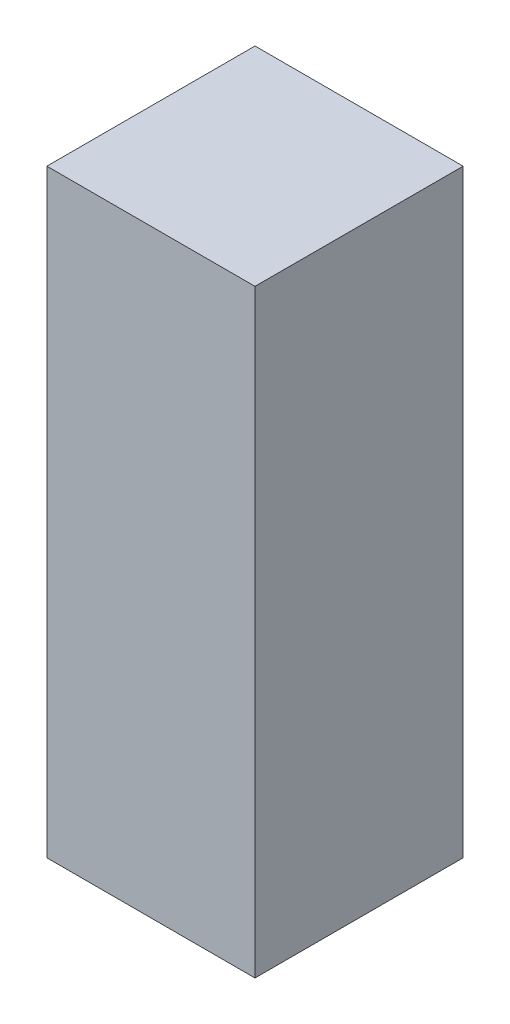
ISO-10303-21;
HEADER;
FILE_DESCRIPTION(('STEP AP214'),'2;1');
FILE_NAME('part.step','',(''),(''),'','','');
FILE_SCHEMA(('AUTOMOTIVE_DESIGN { 1 0 10303 214 1 1 1 1 }'));
ENDSEC;
DATA;
#1=APPLICATION_CONTEXT('core data for automotive mechanical design processes');
#2=APPLICATION_PROTOCOL_DEFINITION('international standard','automotive_design',2000,#1);
#3=PRODUCT_CONTEXT('',#1,'mechanical');
#4=PRODUCT('Part','Part','',(#3));
#5=PRODUCT_RELATED_PRODUCT_CATEGORY('part','',(#4));
#6=PRODUCT_DEFINITION_FORMATION('','',#4);
#7=PRODUCT_DEFINITION_CONTEXT('part definition',#1,'design');
#8=PRODUCT_DEFINITION('design','',#6,#7);
#9=PRODUCT_DEFINITION_SHAPE('','',#8);
#10=(LENGTH_UNIT() NAMED_UNIT(*) SI_UNIT(.MILLI.,.METRE.));
#11=(NAMED_UNIT(*) PLANE_ANGLE_UNIT() SI_UNIT($,.RADIAN.));
#12=(NAMED_UNIT(*) SI_UNIT($,.STERADIAN.) SOLID_ANGLE_UNIT());
#13=UNCERTAINTY_MEASURE_WITH_UNIT(LENGTH_MEASURE(1.E-05),#10,'distance_accuracy_value','');
#14=(GEOMETRIC_REPRESENTATION_CONTEXT(3) GLOBAL_UNCERTAINTY_ASSIGNED_CONTEXT((#13)) GLOBAL_UNIT_ASSIGNED_CONTEXT((#10,
#11,#12)) REPRESENTATION_CONTEXT('',''));
#15=CARTESIAN_POINT('',(0.,0.,0.));
#16=DIRECTION('',(0.,0.,1.));
#17=DIRECTION('',(1.,0.,0.));
#18=AXIS2_PLACEMENT_3D('',#15,#16,#17);
#19=CARTESIAN_POINT('',(-2.02565,-3.3909,-2.6289));
#20=DIRECTION('',(0.707106781186548,-0.707106781186548,0.));
#21=DIRECTION('',(0.707106781186548,0.707106781186548,0.));
#22=AXIS2_PLACEMENT_3D('',#19,#20,#21);
#23=PLANE('',#22);
#24=DIRECTION('',(0.,0.,-1.));
#25=VECTOR('',#24,1.);
#26=CARTESIAN_POINT('',(-1.96215,-3.3274,-2.78765));
#27=LINE('',#26,#25);
#28=CARTESIAN_POINT('',(-1.96215,-3.3274,-2.15265));
#29=VERTEX_POINT('',#28);
#30=CARTESIAN_POINT('',(-1.96215,-3.3274,-2.78765));
#31=VERTEX_POINT('',#30);
#32=EDGE_CURVE('E92',#29,#31,#27,.T.);
#33=ORIENTED_EDGE('',*,*,#32,.F.);
#34=DIRECTION('',(0.577350269189625,0.577350269189627,0.577350269189627));
#35=VECTOR('',#34,1.);
#36=CARTESIAN_POINT('',(-2.08915,-3.4544,-2.27965));
#37=LINE('',#36,#35);
#38=CARTESIAN_POINT('',(-2.08915,-3.4544,-2.27965));
#39=VERTEX_POINT('',#38);
#40=EDGE_CURVE('E73',#39,#29,#37,.T.);
#41=ORIENTED_EDGE('',*,*,#40,.F.);
#42=DIRECTION('',(0.,0.,-1.));
#43=VECTOR('',#42,1.);
#44=CARTESIAN_POINT('',(-2.08915,-3.4544,-2.47015));
#45=LINE('',#44,#43);
#46=CARTESIAN_POINT('',(-2.08915,-3.4544,-2.66065));
#47=VERTEX_POINT('',#46);
#48=EDGE_CURVE('E20',#47,#39,#45,.F.);
#49=ORIENTED_EDGE('',*,*,#48,.F.);
#50=DIRECTION('',(-0.577350269189624,-0.577350269189626,0.577350269189628));
#51=VECTOR('',#50,1.);
#52=CARTESIAN_POINT('',(-1.96215,-3.3274,-2.78765));
#53=LINE('',#52,#51);
#54=EDGE_CURVE('E71',#31,#47,#53,.T.);
#55=ORIENTED_EDGE('',*,*,#54,.F.);
#56=EDGE_LOOP('',(#33,#41,#49,#55));
#57=FACE_BOUND('',#56,.T.);
#58=ADVANCED_FACE('F17',(#57),#23,.T.);
#59=CARTESIAN_POINT('',(-2.27965,-3.4544,-2.47015));
#60=DIRECTION('',(0.,-1.,0.));
#61=DIRECTION('',(0.,0.,-1.));
#62=AXIS2_PLACEMENT_3D('',#59,#60,#61);
#63=PLANE('',#62);
#64=ORIENTED_EDGE('',*,*,#48,.T.);
#65=DIRECTION('',(1.,0.,0.));
#66=VECTOR('',#65,1.);
#67=CARTESIAN_POINT('',(-2.1209,-3.4544,-2.27965));
#68=LINE('',#67,#66);
#69=CARTESIAN_POINT('',(-2.47015,-3.4544,-2.27965));
#70=VERTEX_POINT('',#69);
#71=EDGE_CURVE('E82',#70,#39,#68,.T.);
#72=ORIENTED_EDGE('',*,*,#71,.F.);
#73=DIRECTION('',(0.,0.,1.));
#74=VECTOR('',#73,1.);
#75=CARTESIAN_POINT('',(-2.47015,-3.4544,-2.3114));
#76=LINE('',#75,#74);
#77=CARTESIAN_POINT('',(-2.47015,-3.4544,-2.66065));
#78=VERTEX_POINT('',#77);
#79=EDGE_CURVE('E79',#78,#70,#76,.T.);
#80=ORIENTED_EDGE('',*,*,#79,.F.);
#81=DIRECTION('',(1.,0.,0.));
#82=VECTOR('',#81,1.);
#83=CARTESIAN_POINT('',(-2.4384,-3.4544,-2.66065));
#84=LINE('',#83,#82);
#85=EDGE_CURVE('E76',#47,#78,#84,.F.);
#86=ORIENTED_EDGE('',*,*,#85,.F.);
#87=EDGE_LOOP('',(#64,#72,#80,#86));
#88=FACE_BOUND('',#87,.T.);
#89=ADVANCED_FACE('F77',(#88),#63,.T.);
#90=CARTESIAN_POINT('',(-2.4384,-3.3909,-2.72415));
#91=DIRECTION('',(0.,-0.707106781186548,-0.707106781186548));
#92=DIRECTION('',(0.,0.707106781186548,-0.707106781186548));
#93=AXIS2_PLACEMENT_3D('',#90,#91,#92);
#94=PLANE('',#93);
#95=ORIENTED_EDGE('',*,*,#85,.T.);
#96=DIRECTION('',(0.577350269189625,-0.577350269189625,0.577350269189627));
#97=VECTOR('',#96,1.);
#98=CARTESIAN_POINT('',(-2.59715,-3.3274,-2.78765));
#99=LINE('',#98,#97);
#100=CARTESIAN_POINT('',(-2.59715,-3.3274,-2.78765));
#101=VERTEX_POINT('',#100);
#102=EDGE_CURVE('E105',#101,#78,#99,.T.);
#103=ORIENTED_EDGE('',*,*,#102,.F.);
#104=DIRECTION('',(-1.,0.,0.));
#105=VECTOR('',#104,1.);
#106=CARTESIAN_POINT('',(-2.59715,-3.3274,-2.78765));
#107=LINE('',#106,#105);
#108=EDGE_CURVE('E87',#31,#101,#107,.T.);
#109=ORIENTED_EDGE('',*,*,#108,.F.);
#110=ORIENTED_EDGE('',*,*,#54,.T.);
#111=EDGE_LOOP('',(#95,#103,#109,#110));
#112=FACE_BOUND('',#111,.T.);
#113=ADVANCED_FACE('F85',(#112),#94,.T.);
#114=CARTESIAN_POINT('',(-2.1209,-3.3909,-2.21615));
#115=DIRECTION('',(0.,-0.707106781186548,0.707106781186548));
#116=DIRECTION('',(0.,-0.707106781186548,-0.707106781186548));
#117=AXIS2_PLACEMENT_3D('',#114,#115,#116);
#118=PLANE('',#117);
#119=DIRECTION('',(1.,0.,0.));
#120=VECTOR('',#119,1.);
#121=CARTESIAN_POINT('',(-1.96215,-3.3274,-2.15265));
#122=LINE('',#121,#120);
#123=CARTESIAN_POINT('',(-2.59715,-3.3274,-2.15265));
#124=VERTEX_POINT('',#123);
#125=EDGE_CURVE('E35',#124,#29,#122,.T.);
#126=ORIENTED_EDGE('',*,*,#125,.F.);
#127=DIRECTION('',(-0.577350269189626,0.577350269189626,0.577350269189626));
#128=VECTOR('',#127,1.);
#129=CARTESIAN_POINT('',(-2.47015,-3.4544,-2.27965));
#130=LINE('',#129,#128);
#131=EDGE_CURVE('E103',#70,#124,#130,.T.);
#132=ORIENTED_EDGE('',*,*,#131,.F.);
#133=ORIENTED_EDGE('',*,*,#71,.T.);
#134=ORIENTED_EDGE('',*,*,#40,.T.);
#135=EDGE_LOOP('',(#126,#132,#133,#134));
#136=FACE_BOUND('',#135,.T.);
#137=ADVANCED_FACE('F139',(#136),#118,.T.);
#138=CARTESIAN_POINT('',(-1.96215,0.127,-2.78765));
#139=DIRECTION('',(1.,0.,0.));
#140=DIRECTION('',(0.,0.,-1.));
#141=AXIS2_PLACEMENT_3D('',#138,#139,#140);
#142=PLANE('',#141);
#143=ORIENTED_EDGE('',*,*,#32,.T.);
#144=DIRECTION('',(0.,1.,0.));
#145=VECTOR('',#144,1.);
#146=CARTESIAN_POINT('',(-1.96215,0.127,-2.78765));
#147=LINE('',#146,#145);
#148=CARTESIAN_POINT('',(-1.96215,-1.49999995944139,-2.78765));
#149=VERTEX_POINT('',#148);
#150=EDGE_CURVE('E99',#149,#31,#147,.F.);
#151=ORIENTED_EDGE('',*,*,#150,.F.);
#152=DIRECTION('',(0.,0.,-1.));
#153=VECTOR('',#152,1.);
#154=CARTESIAN_POINT('',(-1.96215,-1.4999999594414,-7.17049999999999));
#155=LINE('',#154,#153);
#156=CARTESIAN_POINT('',(-1.96215,-1.49999995944139,-2.15265));
#157=VERTEX_POINT('',#156);
#158=EDGE_CURVE('E94',#149,#157,#155,.F.);
#159=ORIENTED_EDGE('',*,*,#158,.T.);
#160=DIRECTION('',(0.,1.,0.));
#161=VECTOR('',#160,1.);
#162=CARTESIAN_POINT('',(-1.96215,0.127,-2.15265));
#163=LINE('',#162,#161);
#164=EDGE_CURVE('E111',#29,#157,#163,.T.);
#165=ORIENTED_EDGE('',*,*,#164,.F.);
#166=EDGE_LOOP('',(#143,#151,#159,#165));
#167=FACE_BOUND('',#166,.T.);
#168=ADVANCED_FACE('F138',(#167),#142,.T.);
#169=CARTESIAN_POINT('',(36.5829594414537,-1.4999999594414,-7.17049999999999));
#170=DIRECTION('',(0.,-1.,0.));
#171=DIRECTION('',(0.,0.,-1.));
#172=AXIS2_PLACEMENT_3D('',#169,#170,#171);
#173=PLANE('',#172);
#174=DIRECTION('',(0.,0.,1.));
#175=VECTOR('',#174,1.);
#176=CARTESIAN_POINT('',(-2.59715,-1.49999995944139,-2.15265));
#177=LINE('',#176,#175);
#178=CARTESIAN_POINT('',(-2.59715,-1.49999995944139,-2.15265));
#179=VERTEX_POINT('',#178);
#180=CARTESIAN_POINT('',(-2.59715,-1.49999995944139,-2.78765));
#181=VERTEX_POINT('',#180);
#182=EDGE_CURVE('E114',#179,#181,#177,.F.);
#183=ORIENTED_EDGE('',*,*,#182,.F.);
#184=DIRECTION('',(1.,0.,0.));
#185=VECTOR('',#184,1.);
#186=CARTESIAN_POINT('',(-1.96215,-1.49999995944139,-2.15265));
#187=LINE('',#186,#185);
#188=EDGE_CURVE('E107',#157,#179,#187,.F.);
#189=ORIENTED_EDGE('',*,*,#188,.F.);
#190=ORIENTED_EDGE('',*,*,#158,.F.);
#191=DIRECTION('',(-1.,0.,0.));
#192=VECTOR('',#191,1.);
#193=CARTESIAN_POINT('',(-2.59715,-1.49999995944139,-2.78765));
#194=LINE('',#193,#192);
#195=EDGE_CURVE('E96',#181,#149,#194,.F.);
#196=ORIENTED_EDGE('',*,*,#195,.F.);
#197=EDGE_LOOP('',(#183,#189,#190,#196));
#198=FACE_BOUND('',#197,.T.);
#199=ADVANCED_FACE('F133',(#198),#173,.F.);
#200=CARTESIAN_POINT('',(-2.59715,0.127,-2.78765));
#201=DIRECTION('',(0.,0.,-1.));
#202=DIRECTION('',(-1.,0.,0.));
#203=AXIS2_PLACEMENT_3D('',#200,#201,#202);
#204=PLANE('',#203);
#205=ORIENTED_EDGE('',*,*,#108,.T.);
#206=DIRECTION('',(0.,1.,0.));
#207=VECTOR('',#206,1.);
#208=CARTESIAN_POINT('',(-2.59715,0.127,-2.78765));
#209=LINE('',#208,#207);
#210=EDGE_CURVE('E117',#181,#101,#209,.F.);
#211=ORIENTED_EDGE('',*,*,#210,.F.);
#212=ORIENTED_EDGE('',*,*,#195,.T.);
#213=ORIENTED_EDGE('',*,*,#150,.T.);
#214=EDGE_LOOP('',(#205,#211,#212,#213));
#215=FACE_BOUND('',#214,.T.);
#216=ADVANCED_FACE('F136',(#215),#204,.T.);
#217=CARTESIAN_POINT('',(-2.53365,-3.3909,-2.3114));
#218=DIRECTION('',(-0.707106781186548,-0.707106781186548,0.));
#219=DIRECTION('',(0.707106781186548,-0.707106781186548,0.));
#220=AXIS2_PLACEMENT_3D('',#217,#218,#219);
#221=PLANE('',#220);
#222=DIRECTION('',(0.,0.,1.));
#223=VECTOR('',#222,1.);
#224=CARTESIAN_POINT('',(-2.59715,-3.3274,-2.15265));
#225=LINE('',#224,#223);
#226=EDGE_CURVE('E26',#101,#124,#225,.T.);
#227=ORIENTED_EDGE('',*,*,#226,.F.);
#228=ORIENTED_EDGE('',*,*,#102,.T.);
#229=ORIENTED_EDGE('',*,*,#79,.T.);
#230=ORIENTED_EDGE('',*,*,#131,.T.);
#231=EDGE_LOOP('',(#227,#228,#229,#230));
#232=FACE_BOUND('',#231,.T.);
#233=ADVANCED_FACE('F127',(#232),#221,.T.);
#234=CARTESIAN_POINT('',(-1.96215,0.127,-2.15265));
#235=DIRECTION('',(0.,0.,1.));
#236=DIRECTION('',(1.,0.,0.));
#237=AXIS2_PLACEMENT_3D('',#234,#235,#236);
#238=PLANE('',#237);
#239=ORIENTED_EDGE('',*,*,#125,.T.);
#240=ORIENTED_EDGE('',*,*,#164,.T.);
#241=ORIENTED_EDGE('',*,*,#188,.T.);
#242=DIRECTION('',(0.,1.,0.));
#243=VECTOR('',#242,1.);
#244=CARTESIAN_POINT('',(-2.59715,0.127,-2.15265));
#245=LINE('',#244,#243);
#246=EDGE_CURVE('E11',#124,#179,#245,.T.);
#247=ORIENTED_EDGE('',*,*,#246,.F.);
#248=EDGE_LOOP('',(#239,#240,#241,#247));
#249=FACE_BOUND('',#248,.T.);
#250=ADVANCED_FACE('F129',(#249),#238,.T.);
#251=CARTESIAN_POINT('',(-2.59715,0.127,-2.15265));
#252=DIRECTION('',(-1.,0.,0.));
#253=DIRECTION('',(0.,0.,1.));
#254=AXIS2_PLACEMENT_3D('',#251,#252,#253);
#255=PLANE('',#254);
#256=ORIENTED_EDGE('',*,*,#226,.T.);
#257=ORIENTED_EDGE('',*,*,#246,.T.);
#258=ORIENTED_EDGE('',*,*,#182,.T.);
#259=ORIENTED_EDGE('',*,*,#210,.T.);
#260=EDGE_LOOP('',(#256,#257,#258,#259));
#261=FACE_BOUND('',#260,.T.);
#262=ADVANCED_FACE('F123',(#261),#255,.T.);
#263=CLOSED_SHELL('',(#58,#89,#113,#137,#168,#199,#216,#233,#250,#262));
#264=MANIFOLD_SOLID_BREP('B1',#263);
#265=ADVANCED_BREP_SHAPE_REPRESENTATION('',(#18,#264),#14);
#266=SHAPE_DEFINITION_REPRESENTATION(#9,#265);
ENDSEC;
END-ISO-10303-21;
